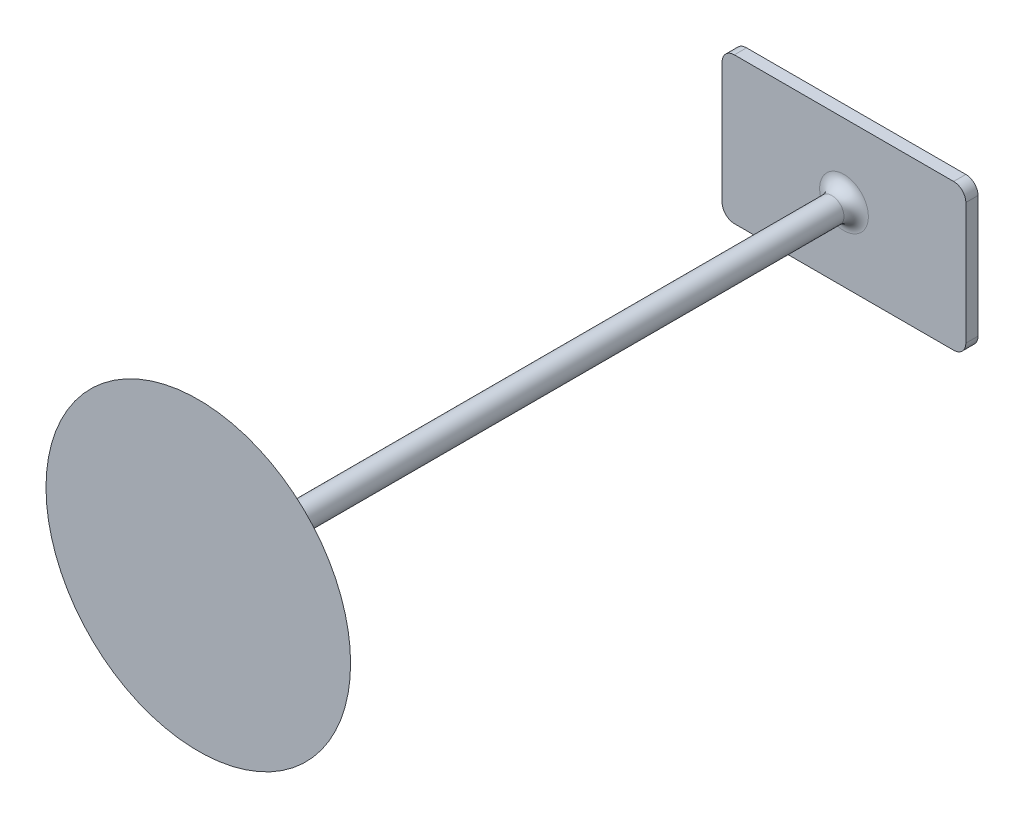
ISO-10303-21;
HEADER;
FILE_DESCRIPTION(('STEP AP214'),'2;1');
FILE_NAME('part.step','',(''),(''),'','','');
FILE_SCHEMA(('AUTOMOTIVE_DESIGN { 1 0 10303 214 1 1 1 1 }'));
ENDSEC;
DATA;
#1=APPLICATION_CONTEXT('core data for automotive mechanical design processes');
#2=APPLICATION_PROTOCOL_DEFINITION('international standard','automotive_design',2000,#1);
#3=PRODUCT_CONTEXT('',#1,'mechanical');
#4=PRODUCT('Part','Part','',(#3));
#5=PRODUCT_RELATED_PRODUCT_CATEGORY('part','',(#4));
#6=PRODUCT_DEFINITION_FORMATION('','',#4);
#7=PRODUCT_DEFINITION_CONTEXT('part definition',#1,'design');
#8=PRODUCT_DEFINITION('design','',#6,#7);
#9=PRODUCT_DEFINITION_SHAPE('','',#8);
#10=(LENGTH_UNIT() NAMED_UNIT(*) SI_UNIT(.MILLI.,.METRE.));
#11=(NAMED_UNIT(*) PLANE_ANGLE_UNIT() SI_UNIT($,.RADIAN.));
#12=(NAMED_UNIT(*) SI_UNIT($,.STERADIAN.) SOLID_ANGLE_UNIT());
#13=UNCERTAINTY_MEASURE_WITH_UNIT(LENGTH_MEASURE(1.E-05),#10,'distance_accuracy_value','');
#14=(GEOMETRIC_REPRESENTATION_CONTEXT(3) GLOBAL_UNCERTAINTY_ASSIGNED_CONTEXT((#13)) GLOBAL_UNIT_ASSIGNED_CONTEXT((#10,
#11,#12)) REPRESENTATION_CONTEXT('',''));
#15=CARTESIAN_POINT('',(0.,0.,0.));
#16=DIRECTION('',(0.,0.,1.));
#17=DIRECTION('',(1.,0.,0.));
#18=AXIS2_PLACEMENT_3D('',#15,#16,#17);
#19=CARTESIAN_POINT('',(9.,5.,1.));
#20=DIRECTION('',(0.,0.,-1.));
#21=DIRECTION('',(-1.,0.,0.));
#22=AXIS2_PLACEMENT_3D('',#19,#20,#21);
#23=CYLINDRICAL_SURFACE('',#22,1.);
#24=CARTESIAN_POINT('',(9.,5.,0.));
#25=DIRECTION('',(0.,0.,1.));
#26=DIRECTION('',(-1.,0.,0.));
#27=AXIS2_PLACEMENT_3D('',#24,#25,#26);
#28=CIRCLE('',#27,1.);
#29=CARTESIAN_POINT('',(10.,4.99999999999999,0.));
#30=VERTEX_POINT('',#29);
#31=CARTESIAN_POINT('',(8.99999999999999,6.,0.));
#32=VERTEX_POINT('',#31);
#33=EDGE_CURVE('E131',#30,#32,#28,.T.);
#34=ORIENTED_EDGE('',*,*,#33,.T.);
#35=DIRECTION('',(0.,0.,-1.));
#36=VECTOR('',#35,1.);
#37=CARTESIAN_POINT('',(8.99999999999999,6.,1.));
#38=LINE('',#37,#36);
#39=CARTESIAN_POINT('',(8.99999999999999,6.,1.));
#40=VERTEX_POINT('',#39);
#41=EDGE_CURVE('E159',#40,#32,#38,.T.);
#42=ORIENTED_EDGE('',*,*,#41,.F.);
#43=CARTESIAN_POINT('',(9.,5.,1.));
#44=DIRECTION('',(0.,0.,1.));
#45=DIRECTION('',(-1.,0.,0.));
#46=AXIS2_PLACEMENT_3D('',#43,#44,#45);
#47=CIRCLE('',#46,1.);
#48=CARTESIAN_POINT('',(10.,4.99999999999999,1.));
#49=VERTEX_POINT('',#48);
#50=EDGE_CURVE('E146',#49,#40,#47,.T.);
#51=ORIENTED_EDGE('',*,*,#50,.F.);
#52=DIRECTION('',(0.,0.,-1.));
#53=VECTOR('',#52,1.);
#54=CARTESIAN_POINT('',(10.,4.99999999999999,1.));
#55=LINE('',#54,#53);
#56=EDGE_CURVE('E127',#49,#30,#55,.T.);
#57=ORIENTED_EDGE('',*,*,#56,.T.);
#58=EDGE_LOOP('',(#34,#42,#51,#57));
#59=FACE_BOUND('',#58,.T.);
#60=ADVANCED_FACE('F33',(#59),#23,.T.);
#61=CARTESIAN_POINT('',(-8.99999999999999,6.,1.));
#62=DIRECTION('',(0.,-1.,0.));
#63=DIRECTION('',(0.,0.,-1.));
#64=AXIS2_PLACEMENT_3D('',#61,#62,#63);
#65=PLANE('',#64);
#66=DIRECTION('',(-1.,0.,0.));
#67=VECTOR('',#66,1.);
#68=CARTESIAN_POINT('',(-8.99999999999999,6.,0.));
#69=LINE('',#68,#67);
#70=CARTESIAN_POINT('',(-8.99999999999999,6.,0.));
#71=VERTEX_POINT('',#70);
#72=EDGE_CURVE('E134',#32,#71,#69,.T.);
#73=ORIENTED_EDGE('',*,*,#72,.T.);
#74=DIRECTION('',(0.,0.,-1.));
#75=VECTOR('',#74,1.);
#76=CARTESIAN_POINT('',(-8.99999999999999,6.,1.));
#77=LINE('',#76,#75);
#78=CARTESIAN_POINT('',(-8.99999999999999,6.,1.));
#79=VERTEX_POINT('',#78);
#80=EDGE_CURVE('E156',#79,#71,#77,.T.);
#81=ORIENTED_EDGE('',*,*,#80,.F.);
#82=DIRECTION('',(-1.,0.,0.));
#83=VECTOR('',#82,1.);
#84=CARTESIAN_POINT('',(-8.99999999999999,6.,1.));
#85=LINE('',#84,#83);
#86=EDGE_CURVE('E94',#40,#79,#85,.T.);
#87=ORIENTED_EDGE('',*,*,#86,.F.);
#88=ORIENTED_EDGE('',*,*,#41,.T.);
#89=EDGE_LOOP('',(#73,#81,#87,#88));
#90=FACE_BOUND('',#89,.T.);
#91=ADVANCED_FACE('F181',(#90),#65,.F.);
#92=CARTESIAN_POINT('',(-9.,5.,1.));
#93=DIRECTION('',(0.,0.,-1.));
#94=DIRECTION('',(-1.,0.,0.));
#95=AXIS2_PLACEMENT_3D('',#92,#93,#94);
#96=CYLINDRICAL_SURFACE('',#95,1.);
#97=CARTESIAN_POINT('',(-9.,5.,0.));
#98=DIRECTION('',(0.,0.,1.));
#99=DIRECTION('',(1.,0.,0.));
#100=AXIS2_PLACEMENT_3D('',#97,#98,#99);
#101=CIRCLE('',#100,1.);
#102=CARTESIAN_POINT('',(-10.,4.99999999999999,0.));
#103=VERTEX_POINT('',#102);
#104=EDGE_CURVE('E137',#71,#103,#101,.T.);
#105=ORIENTED_EDGE('',*,*,#104,.T.);
#106=DIRECTION('',(0.,0.,-1.));
#107=VECTOR('',#106,1.);
#108=CARTESIAN_POINT('',(-10.,4.99999999999999,1.));
#109=LINE('',#108,#107);
#110=CARTESIAN_POINT('',(-10.,4.99999999999999,1.));
#111=VERTEX_POINT('',#110);
#112=EDGE_CURVE('E153',#111,#103,#109,.T.);
#113=ORIENTED_EDGE('',*,*,#112,.F.);
#114=CARTESIAN_POINT('',(-9.,5.,1.));
#115=DIRECTION('',(0.,0.,1.));
#116=DIRECTION('',(1.,0.,0.));
#117=AXIS2_PLACEMENT_3D('',#114,#115,#116);
#118=CIRCLE('',#117,1.);
#119=EDGE_CURVE('E318',#79,#111,#118,.T.);
#120=ORIENTED_EDGE('',*,*,#119,.F.);
#121=ORIENTED_EDGE('',*,*,#80,.T.);
#122=EDGE_LOOP('',(#105,#113,#120,#121));
#123=FACE_BOUND('',#122,.T.);
#124=ADVANCED_FACE('F187',(#123),#96,.T.);
#125=CARTESIAN_POINT('',(-10.,4.99999999999999,1.));
#126=DIRECTION('',(1.,0.,0.));
#127=DIRECTION('',(0.,1.,0.));
#128=AXIS2_PLACEMENT_3D('',#125,#126,#127);
#129=PLANE('',#128);
#130=DIRECTION('',(0.,-1.,0.));
#131=VECTOR('',#130,1.);
#132=CARTESIAN_POINT('',(-10.,4.99999999999999,0.));
#133=LINE('',#132,#131);
#134=CARTESIAN_POINT('',(-9.99999999999999,-4.99999999999999,0.));
#135=VERTEX_POINT('',#134);
#136=EDGE_CURVE('E139',#103,#135,#133,.T.);
#137=ORIENTED_EDGE('',*,*,#136,.T.);
#138=DIRECTION('',(0.,0.,-1.));
#139=VECTOR('',#138,1.);
#140=CARTESIAN_POINT('',(-9.99999999999999,-4.99999999999999,1.));
#141=LINE('',#140,#139);
#142=CARTESIAN_POINT('',(-9.99999999999999,-4.99999999999999,1.));
#143=VERTEX_POINT('',#142);
#144=EDGE_CURVE('E150',#143,#135,#141,.T.);
#145=ORIENTED_EDGE('',*,*,#144,.F.);
#146=DIRECTION('',(0.,-1.,0.));
#147=VECTOR('',#146,1.);
#148=CARTESIAN_POINT('',(-10.,4.99999999999999,1.));
#149=LINE('',#148,#147);
#150=EDGE_CURVE('E320',#111,#143,#149,.T.);
#151=ORIENTED_EDGE('',*,*,#150,.F.);
#152=ORIENTED_EDGE('',*,*,#112,.T.);
#153=EDGE_LOOP('',(#137,#145,#151,#152));
#154=FACE_BOUND('',#153,.T.);
#155=ADVANCED_FACE('F192',(#154),#129,.F.);
#156=CARTESIAN_POINT('',(-9.,-5.,1.));
#157=DIRECTION('',(0.,0.,-1.));
#158=DIRECTION('',(-1.,0.,0.));
#159=AXIS2_PLACEMENT_3D('',#156,#157,#158);
#160=CYLINDRICAL_SURFACE('',#159,1.);
#161=CARTESIAN_POINT('',(-9.,-5.,0.));
#162=DIRECTION('',(0.,0.,1.));
#163=DIRECTION('',(1.,0.,0.));
#164=AXIS2_PLACEMENT_3D('',#161,#162,#163);
#165=CIRCLE('',#164,1.);
#166=CARTESIAN_POINT('',(-8.99999999999999,-6.,0.));
#167=VERTEX_POINT('',#166);
#168=EDGE_CURVE('E141',#135,#167,#165,.T.);
#169=ORIENTED_EDGE('',*,*,#168,.T.);
#170=DIRECTION('',(0.,0.,-1.));
#171=VECTOR('',#170,1.);
#172=CARTESIAN_POINT('',(-8.99999999999999,-6.,1.));
#173=LINE('',#172,#171);
#174=CARTESIAN_POINT('',(-8.99999999999999,-6.,1.));
#175=VERTEX_POINT('',#174);
#176=EDGE_CURVE('E122',#175,#167,#173,.T.);
#177=ORIENTED_EDGE('',*,*,#176,.F.);
#178=CARTESIAN_POINT('',(-9.,-5.,1.));
#179=DIRECTION('',(0.,0.,1.));
#180=DIRECTION('',(1.,0.,0.));
#181=AXIS2_PLACEMENT_3D('',#178,#179,#180);
#182=CIRCLE('',#181,1.);
#183=EDGE_CURVE('E113',#143,#175,#182,.T.);
#184=ORIENTED_EDGE('',*,*,#183,.F.);
#185=ORIENTED_EDGE('',*,*,#144,.T.);
#186=EDGE_LOOP('',(#169,#177,#184,#185));
#187=FACE_BOUND('',#186,.T.);
#188=ADVANCED_FACE('F196',(#187),#160,.T.);
#189=CARTESIAN_POINT('',(-8.99999999999999,-6.,1.));
#190=DIRECTION('',(0.,1.,0.));
#191=DIRECTION('',(0.,0.,1.));
#192=AXIS2_PLACEMENT_3D('',#189,#190,#191);
#193=PLANE('',#192);
#194=DIRECTION('',(1.,0.,0.));
#195=VECTOR('',#194,1.);
#196=CARTESIAN_POINT('',(-8.99999999999999,-6.,0.));
#197=LINE('',#196,#195);
#198=CARTESIAN_POINT('',(8.99999999999999,-6.,0.));
#199=VERTEX_POINT('',#198);
#200=EDGE_CURVE('E121',#167,#199,#197,.T.);
#201=ORIENTED_EDGE('',*,*,#200,.T.);
#202=DIRECTION('',(0.,0.,-1.));
#203=VECTOR('',#202,1.);
#204=CARTESIAN_POINT('',(8.99999999999999,-6.,1.));
#205=LINE('',#204,#203);
#206=CARTESIAN_POINT('',(8.99999999999999,-6.,1.));
#207=VERTEX_POINT('',#206);
#208=EDGE_CURVE('E118',#207,#199,#205,.T.);
#209=ORIENTED_EDGE('',*,*,#208,.F.);
#210=DIRECTION('',(1.,0.,0.));
#211=VECTOR('',#210,1.);
#212=CARTESIAN_POINT('',(-8.99999999999999,-6.,1.));
#213=LINE('',#212,#211);
#214=EDGE_CURVE('E107',#175,#207,#213,.T.);
#215=ORIENTED_EDGE('',*,*,#214,.F.);
#216=ORIENTED_EDGE('',*,*,#176,.T.);
#217=EDGE_LOOP('',(#201,#209,#215,#216));
#218=FACE_BOUND('',#217,.T.);
#219=ADVANCED_FACE('F119',(#218),#193,.F.);
#220=CARTESIAN_POINT('',(9.,-5.,1.));
#221=DIRECTION('',(0.,0.,-1.));
#222=DIRECTION('',(-1.,0.,0.));
#223=AXIS2_PLACEMENT_3D('',#220,#221,#222);
#224=CYLINDRICAL_SURFACE('',#223,1.);
#225=CARTESIAN_POINT('',(9.,-5.,0.));
#226=DIRECTION('',(0.,0.,1.));
#227=DIRECTION('',(1.,0.,0.));
#228=AXIS2_PLACEMENT_3D('',#225,#226,#227);
#229=CIRCLE('',#228,1.);
#230=CARTESIAN_POINT('',(10.,-5.,0.));
#231=VERTEX_POINT('',#230);
#232=EDGE_CURVE('E79',#199,#231,#229,.T.);
#233=ORIENTED_EDGE('',*,*,#232,.T.);
#234=DIRECTION('',(0.,0.,-1.));
#235=VECTOR('',#234,1.);
#236=CARTESIAN_POINT('',(10.,-5.,1.));
#237=LINE('',#236,#235);
#238=CARTESIAN_POINT('',(10.,-5.,1.));
#239=VERTEX_POINT('',#238);
#240=EDGE_CURVE('E123',#239,#231,#237,.T.);
#241=ORIENTED_EDGE('',*,*,#240,.F.);
#242=CARTESIAN_POINT('',(9.,-5.,1.));
#243=DIRECTION('',(0.,0.,1.));
#244=DIRECTION('',(1.,0.,0.));
#245=AXIS2_PLACEMENT_3D('',#242,#243,#244);
#246=CIRCLE('',#245,1.);
#247=EDGE_CURVE('E111',#207,#239,#246,.T.);
#248=ORIENTED_EDGE('',*,*,#247,.F.);
#249=ORIENTED_EDGE('',*,*,#208,.T.);
#250=EDGE_LOOP('',(#233,#241,#248,#249));
#251=FACE_BOUND('',#250,.T.);
#252=ADVANCED_FACE('F125',(#251),#224,.T.);
#253=CARTESIAN_POINT('',(10.,4.99999999999999,1.));
#254=DIRECTION('',(-1.,0.,0.));
#255=DIRECTION('',(0.,-1.,0.));
#256=AXIS2_PLACEMENT_3D('',#253,#254,#255);
#257=PLANE('',#256);
#258=DIRECTION('',(0.,1.,0.));
#259=VECTOR('',#258,1.);
#260=CARTESIAN_POINT('',(10.,4.99999999999999,0.));
#261=LINE('',#260,#259);
#262=EDGE_CURVE('E85',#231,#30,#261,.T.);
#263=ORIENTED_EDGE('',*,*,#262,.T.);
#264=ORIENTED_EDGE('',*,*,#56,.F.);
#265=DIRECTION('',(0.,1.,0.));
#266=VECTOR('',#265,1.);
#267=CARTESIAN_POINT('',(10.,4.99999999999999,1.));
#268=LINE('',#267,#266);
#269=EDGE_CURVE('E50',#239,#49,#268,.T.);
#270=ORIENTED_EDGE('',*,*,#269,.F.);
#271=ORIENTED_EDGE('',*,*,#240,.T.);
#272=EDGE_LOOP('',(#263,#264,#270,#271));
#273=FACE_BOUND('',#272,.T.);
#274=ADVANCED_FACE('F205',(#273),#257,.F.);
#275=CARTESIAN_POINT('',(9.,5.,1.));
#276=DIRECTION('',(0.,0.,-1.));
#277=DIRECTION('',(-1.,0.,0.));
#278=AXIS2_PLACEMENT_3D('',#275,#276,#277);
#279=PLANE('',#278);
#280=CARTESIAN_POINT('',(0.,0.,1.));
#281=DIRECTION('',(0.,0.,-1.));
#282=DIRECTION('',(-1.,0.,0.));
#283=AXIS2_PLACEMENT_3D('',#280,#281,#282);
#284=CIRCLE('',#283,2.00000000000001);
#285=CARTESIAN_POINT('',(-2.00000000000001,0.,1.));
#286=VERTEX_POINT('',#285);
#287=EDGE_CURVE('E11',#286,#286,#284,.T.);
#288=ORIENTED_EDGE('',*,*,#287,.T.);
#289=EDGE_LOOP('',(#288));
#290=FACE_BOUND('',#289,.T.);
#291=ORIENTED_EDGE('',*,*,#50,.T.);
#292=ORIENTED_EDGE('',*,*,#86,.T.);
#293=ORIENTED_EDGE('',*,*,#119,.T.);
#294=ORIENTED_EDGE('',*,*,#150,.T.);
#295=ORIENTED_EDGE('',*,*,#183,.T.);
#296=ORIENTED_EDGE('',*,*,#214,.T.);
#297=ORIENTED_EDGE('',*,*,#247,.T.);
#298=ORIENTED_EDGE('',*,*,#269,.T.);
#299=EDGE_LOOP('',(#291,#292,#293,#294,#295,#296,#297,#298));
#300=FACE_BOUND('',#299,.T.);
#301=ADVANCED_FACE('F109',(#290,#300),#279,.F.);
#302=CARTESIAN_POINT('',(9.,5.,0.));
#303=DIRECTION('',(0.,0.,-1.));
#304=DIRECTION('',(-1.,0.,0.));
#305=AXIS2_PLACEMENT_3D('',#302,#303,#304);
#306=PLANE('',#305);
#307=ORIENTED_EDGE('',*,*,#33,.F.);
#308=ORIENTED_EDGE('',*,*,#262,.F.);
#309=ORIENTED_EDGE('',*,*,#232,.F.);
#310=ORIENTED_EDGE('',*,*,#200,.F.);
#311=ORIENTED_EDGE('',*,*,#168,.F.);
#312=ORIENTED_EDGE('',*,*,#136,.F.);
#313=ORIENTED_EDGE('',*,*,#104,.F.);
#314=ORIENTED_EDGE('',*,*,#72,.F.);
#315=EDGE_LOOP('',(#307,#308,#309,#310,#311,#312,#313,#314));
#316=FACE_BOUND('',#315,.T.);
#317=ADVANCED_FACE('F208',(#316),#306,.T.);
#318=CARTESIAN_POINT('',(0.,0.,54.));
#319=DIRECTION('',(0.,0.,-1.));
#320=DIRECTION('',(-1.,0.,0.));
#321=AXIS2_PLACEMENT_3D('',#318,#319,#320);
#322=PLANE('',#321);
#323=CARTESIAN_POINT('',(0.,0.,54.));
#324=DIRECTION('',(0.,0.,-1.));
#325=DIRECTION('',(-1.,0.,0.));
#326=AXIS2_PLACEMENT_3D('',#323,#324,#325);
#327=CIRCLE('',#326,12.5);
#328=CARTESIAN_POINT('',(-12.5,0.,54.));
#329=VERTEX_POINT('',#328);
#330=EDGE_CURVE('E135',#329,#329,#327,.T.);
#331=ORIENTED_EDGE('',*,*,#330,.F.);
#332=EDGE_LOOP('',(#331));
#333=FACE_BOUND('',#332,.T.);
#334=ADVANCED_FACE('F211',(#333),#322,.F.);
#335=CARTESIAN_POINT('',(0.,0.,187.848183663526));
#336=DIRECTION('',(0.,0.,-1.));
#337=DIRECTION('',(-1.,0.,0.));
#338=AXIS2_PLACEMENT_3D('',#335,#336,#337);
#339=DEGENERATE_TOROIDAL_SURFACE('',#338,24.9921822514366,139.,.F.);
#340=CARTESIAN_POINT('',(0.,0.,51.6148955173154));
#341=DIRECTION('',(0.,0.,1.));
#342=DIRECTION('',(1.,0.,0.));
#343=AXIS2_PLACEMENT_3D('',#340,#341,#342);
#344=CIRCLE('',#343,2.60294776948318);
#345=CARTESIAN_POINT('',(2.60294776948318,0.,51.6148955173154));
#346=VERTEX_POINT('',#345);
#347=EDGE_CURVE('E164',#346,#346,#344,.T.);
#348=ORIENTED_EDGE('',*,*,#347,.T.);
#349=EDGE_LOOP('',(#348));
#350=FACE_BOUND('',#349,.T.);
#351=ORIENTED_EDGE('',*,*,#330,.T.);
#352=EDGE_LOOP('',(#351));
#353=FACE_BOUND('',#352,.T.);
#354=ADVANCED_FACE('F218',(#350,#353),#339,.F.);
#355=CARTESIAN_POINT('',(0.,0.,1.));
#356=DIRECTION('',(0.,0.,-1.));
#357=DIRECTION('',(-1.,0.,0.));
#358=AXIS2_PLACEMENT_3D('',#355,#356,#357);
#359=CYLINDRICAL_SURFACE('',#358,1.00000000000001);
#360=CARTESIAN_POINT('',(0.,0.,2.));
#361=DIRECTION('',(0.,0.,-1.));
#362=DIRECTION('',(-1.,0.,0.));
#363=AXIS2_PLACEMENT_3D('',#360,#361,#362);
#364=CIRCLE('',#363,1.00000000000001);
#365=CARTESIAN_POINT('',(-1.00000000000001,0.,2.));
#366=VERTEX_POINT('',#365);
#367=EDGE_CURVE('E42',#366,#366,#364,.F.);
#368=ORIENTED_EDGE('',*,*,#367,.T.);
#369=EDGE_LOOP('',(#368));
#370=FACE_BOUND('',#369,.T.);
#371=CARTESIAN_POINT('',(0.,0.,49.654704320967));
#372=DIRECTION('',(0.,0.,-1.));
#373=DIRECTION('',(-1.,0.,0.));
#374=AXIS2_PLACEMENT_3D('',#371,#372,#373);
#375=CIRCLE('',#374,1.00000000000001);
#376=CARTESIAN_POINT('',(-1.00000000000001,0.,49.654704320967));
#377=VERTEX_POINT('',#376);
#378=EDGE_CURVE('E161',#377,#377,#375,.T.);
#379=ORIENTED_EDGE('',*,*,#378,.T.);
#380=EDGE_LOOP('',(#379));
#381=FACE_BOUND('',#380,.T.);
#382=ADVANCED_FACE('F169',(#370,#381),#359,.T.);
#383=CARTESIAN_POINT('',(0.,0.,49.654704320967));
#384=DIRECTION('',(0.,0.,-1.));
#385=DIRECTION('',(-1.,0.,0.));
#386=AXIS2_PLACEMENT_3D('',#383,#384,#385);
#387=TOROIDAL_SURFACE('',#386,3.,2.);
#388=ORIENTED_EDGE('',*,*,#347,.F.);
#389=EDGE_LOOP('',(#388));
#390=FACE_BOUND('',#389,.T.);
#391=ORIENTED_EDGE('',*,*,#378,.F.);
#392=EDGE_LOOP('',(#391));
#393=FACE_BOUND('',#392,.T.);
#394=ADVANCED_FACE('F173',(#390,#393),#387,.F.);
#395=CARTESIAN_POINT('',(0.,0.,2.));
#396=DIRECTION('',(0.,0.,-1.));
#397=DIRECTION('',(-1.,0.,0.));
#398=AXIS2_PLACEMENT_3D('',#395,#396,#397);
#399=TOROIDAL_SURFACE('',#398,2.00000000000001,1.);
#400=ORIENTED_EDGE('',*,*,#287,.F.);
#401=EDGE_LOOP('',(#400));
#402=FACE_BOUND('',#401,.T.);
#403=ORIENTED_EDGE('',*,*,#367,.F.);
#404=EDGE_LOOP('',(#403));
#405=FACE_BOUND('',#404,.T.);
#406=ADVANCED_FACE('F35',(#402,#405),#399,.F.);
#407=CLOSED_SHELL('',(#60,#91,#124,#155,#188,#219,#252,#274,#301,#317,#334,#354,#382,#394,#406));
#408=MANIFOLD_SOLID_BREP('B2',#407);
#409=ADVANCED_BREP_SHAPE_REPRESENTATION('',(#18,#408),#14);
#410=SHAPE_DEFINITION_REPRESENTATION(#9,#409);
ENDSEC;
END-ISO-10303-21;
